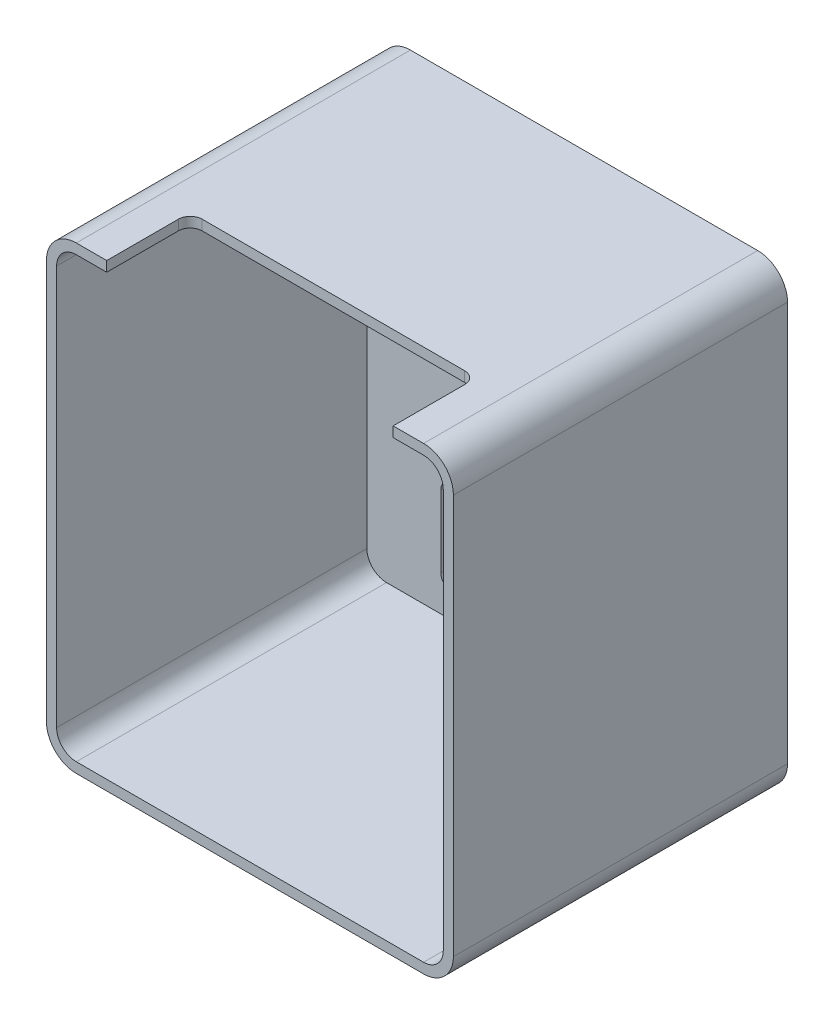
ISO-10303-21;
HEADER;
FILE_DESCRIPTION(('STEP AP214'),'2;1');
FILE_NAME('part.step','',(''),(''),'','','');
FILE_SCHEMA(('AUTOMOTIVE_DESIGN { 1 0 10303 214 1 1 1 1 }'));
ENDSEC;
DATA;
#1=APPLICATION_CONTEXT('core data for automotive mechanical design processes');
#2=APPLICATION_PROTOCOL_DEFINITION('international standard','automotive_design',2000,#1);
#3=PRODUCT_CONTEXT('',#1,'mechanical');
#4=PRODUCT('Part','Part','',(#3));
#5=PRODUCT_RELATED_PRODUCT_CATEGORY('part','',(#4));
#6=PRODUCT_DEFINITION_FORMATION('','',#4);
#7=PRODUCT_DEFINITION_CONTEXT('part definition',#1,'design');
#8=PRODUCT_DEFINITION('design','',#6,#7);
#9=PRODUCT_DEFINITION_SHAPE('','',#8);
#10=(LENGTH_UNIT() NAMED_UNIT(*) SI_UNIT(.MILLI.,.METRE.));
#11=(NAMED_UNIT(*) PLANE_ANGLE_UNIT() SI_UNIT($,.RADIAN.));
#12=(NAMED_UNIT(*) SI_UNIT($,.STERADIAN.) SOLID_ANGLE_UNIT());
#13=UNCERTAINTY_MEASURE_WITH_UNIT(LENGTH_MEASURE(1.E-05),#10,'distance_accuracy_value','');
#14=(GEOMETRIC_REPRESENTATION_CONTEXT(3) GLOBAL_UNCERTAINTY_ASSIGNED_CONTEXT((#13)) GLOBAL_UNIT_ASSIGNED_CONTEXT((#10,
#11,#12)) REPRESENTATION_CONTEXT('',''));
#15=CARTESIAN_POINT('',(0.,0.,0.));
#16=DIRECTION('',(0.,0.,1.));
#17=DIRECTION('',(1.,0.,0.));
#18=AXIS2_PLACEMENT_3D('',#15,#16,#17);
#19=CARTESIAN_POINT('',(0.,18.4,28.));
#20=DIRECTION('',(0.,1.,0.));
#21=DIRECTION('',(0.,0.,1.));
#22=AXIS2_PLACEMENT_3D('',#19,#20,#21);
#23=PLANE('',#22);
#24=DIRECTION('',(0.,0.,1.));
#25=VECTOR('',#24,1.);
#26=CARTESIAN_POINT('',(12.,18.4,28.));
#27=LINE('',#26,#25);
#28=CARTESIAN_POINT('',(12.,18.4,22.));
#29=VERTEX_POINT('',#28);
#30=CARTESIAN_POINT('',(12.,18.4,28.));
#31=VERTEX_POINT('',#30);
#32=EDGE_CURVE('E251',#29,#31,#27,.T.);
#33=ORIENTED_EDGE('',*,*,#32,.F.);
#34=CARTESIAN_POINT('',(11.,18.4,22.));
#35=DIRECTION('',(0.,1.,0.));
#36=DIRECTION('',(0.,0.,1.));
#37=AXIS2_PLACEMENT_3D('',#34,#35,#36);
#38=CIRCLE('',#37,0.999999999999998);
#39=CARTESIAN_POINT('',(11.,18.4,21.));
#40=VERTEX_POINT('',#39);
#41=EDGE_CURVE('E578',#29,#40,#38,.T.);
#42=ORIENTED_EDGE('',*,*,#41,.T.);
#43=DIRECTION('',(-1.,0.,0.));
#44=VECTOR('',#43,1.);
#45=CARTESIAN_POINT('',(0.,18.4,21.));
#46=LINE('',#45,#44);
#47=CARTESIAN_POINT('',(-11.,18.4,21.));
#48=VERTEX_POINT('',#47);
#49=EDGE_CURVE('E670',#40,#48,#46,.T.);
#50=ORIENTED_EDGE('',*,*,#49,.T.);
#51=CARTESIAN_POINT('',(-11.,18.4,22.));
#52=DIRECTION('',(0.,1.,0.));
#53=DIRECTION('',(0.,0.,1.));
#54=AXIS2_PLACEMENT_3D('',#51,#52,#53);
#55=CIRCLE('',#54,0.999999999999998);
#56=CARTESIAN_POINT('',(-12.,18.4,22.));
#57=VERTEX_POINT('',#56);
#58=EDGE_CURVE('E666',#48,#57,#55,.T.);
#59=ORIENTED_EDGE('',*,*,#58,.T.);
#60=DIRECTION('',(0.,0.,1.));
#61=VECTOR('',#60,1.);
#62=CARTESIAN_POINT('',(-12.,18.4,28.));
#63=LINE('',#62,#61);
#64=CARTESIAN_POINT('',(-12.,18.4,28.));
#65=VERTEX_POINT('',#64);
#66=EDGE_CURVE('E256',#57,#65,#63,.T.);
#67=ORIENTED_EDGE('',*,*,#66,.T.);
#68=DIRECTION('',(1.,0.,0.));
#69=VECTOR('',#68,1.);
#70=CARTESIAN_POINT('',(0.,18.4,28.));
#71=LINE('',#70,#69);
#72=CARTESIAN_POINT('',(-14.55,18.4,28.));
#73=VERTEX_POINT('',#72);
#74=EDGE_CURVE('E302',#73,#65,#71,.T.);
#75=ORIENTED_EDGE('',*,*,#74,.F.);
#76=DIRECTION('',(0.,0.,-1.));
#77=VECTOR('',#76,1.);
#78=CARTESIAN_POINT('',(-14.55,18.4,28.));
#79=LINE('',#78,#77);
#80=CARTESIAN_POINT('',(-14.55,18.4,2.));
#81=VERTEX_POINT('',#80);
#82=EDGE_CURVE('E364',#73,#81,#79,.T.);
#83=ORIENTED_EDGE('',*,*,#82,.T.);
#84=DIRECTION('',(1.,0.,0.));
#85=VECTOR('',#84,1.);
#86=CARTESIAN_POINT('',(0.,18.4,2.));
#87=LINE('',#86,#85);
#88=CARTESIAN_POINT('',(14.55,18.4,2.));
#89=VERTEX_POINT('',#88);
#90=EDGE_CURVE('E535',#81,#89,#87,.T.);
#91=ORIENTED_EDGE('',*,*,#90,.T.);
#92=DIRECTION('',(0.,0.,-1.));
#93=VECTOR('',#92,1.);
#94=CARTESIAN_POINT('',(14.55,18.4,28.));
#95=LINE('',#94,#93);
#96=CARTESIAN_POINT('',(14.55,18.4,28.));
#97=VERTEX_POINT('',#96);
#98=EDGE_CURVE('E360',#97,#89,#95,.T.);
#99=ORIENTED_EDGE('',*,*,#98,.F.);
#100=EDGE_CURVE('E301',#31,#97,#71,.T.);
#101=ORIENTED_EDGE('',*,*,#100,.F.);
#102=EDGE_LOOP('',(#33,#42,#50,#59,#67,#75,#83,#91,#99,#101));
#103=FACE_BOUND('',#102,.T.);
#104=ADVANCED_FACE('F45',(#103),#23,.F.);
#105=CARTESIAN_POINT('',(0.,19.25,28.));
#106=DIRECTION('',(0.,1.,0.));
#107=DIRECTION('',(0.,0.,1.));
#108=AXIS2_PLACEMENT_3D('',#105,#106,#107);
#109=PLANE('',#108);
#110=CARTESIAN_POINT('',(11.,19.25,22.));
#111=DIRECTION('',(0.,-1.,0.));
#112=DIRECTION('',(0.,0.,-1.));
#113=AXIS2_PLACEMENT_3D('',#110,#111,#112);
#114=CIRCLE('',#113,0.999999999999998);
#115=CARTESIAN_POINT('',(11.,19.25,21.));
#116=VERTEX_POINT('',#115);
#117=CARTESIAN_POINT('',(12.,19.25,22.));
#118=VERTEX_POINT('',#117);
#119=EDGE_CURVE('E266',#116,#118,#114,.T.);
#120=ORIENTED_EDGE('',*,*,#119,.T.);
#121=DIRECTION('',(0.,0.,-1.));
#122=VECTOR('',#121,1.);
#123=CARTESIAN_POINT('',(12.,19.25,28.));
#124=LINE('',#123,#122);
#125=CARTESIAN_POINT('',(12.,19.25,28.));
#126=VERTEX_POINT('',#125);
#127=EDGE_CURVE('E248',#126,#118,#124,.T.);
#128=ORIENTED_EDGE('',*,*,#127,.F.);
#129=DIRECTION('',(1.,0.,0.));
#130=VECTOR('',#129,1.);
#131=CARTESIAN_POINT('',(0.,19.25,28.));
#132=LINE('',#131,#130);
#133=CARTESIAN_POINT('',(14.55,19.25,28.));
#134=VERTEX_POINT('',#133);
#135=EDGE_CURVE('E262',#126,#134,#132,.T.);
#136=ORIENTED_EDGE('',*,*,#135,.T.);
#137=DIRECTION('',(0.,0.,-1.));
#138=VECTOR('',#137,1.);
#139=CARTESIAN_POINT('',(14.55,19.25,28.));
#140=LINE('',#139,#138);
#141=CARTESIAN_POINT('',(14.55,19.25,0.));
#142=VERTEX_POINT('',#141);
#143=EDGE_CURVE('E377',#134,#142,#140,.T.);
#144=ORIENTED_EDGE('',*,*,#143,.T.);
#145=DIRECTION('',(1.,0.,0.));
#146=VECTOR('',#145,1.);
#147=CARTESIAN_POINT('',(0.,19.25,0.));
#148=LINE('',#147,#146);
#149=CARTESIAN_POINT('',(-14.55,19.25,0.));
#150=VERTEX_POINT('',#149);
#151=EDGE_CURVE('E345',#150,#142,#148,.T.);
#152=ORIENTED_EDGE('',*,*,#151,.F.);
#153=DIRECTION('',(0.,0.,-1.));
#154=VECTOR('',#153,1.);
#155=CARTESIAN_POINT('',(-14.55,19.25,28.));
#156=LINE('',#155,#154);
#157=CARTESIAN_POINT('',(-14.55,19.25,28.));
#158=VERTEX_POINT('',#157);
#159=EDGE_CURVE('E317',#158,#150,#156,.T.);
#160=ORIENTED_EDGE('',*,*,#159,.F.);
#161=CARTESIAN_POINT('',(-12.,19.25,28.));
#162=VERTEX_POINT('',#161);
#163=EDGE_CURVE('E274',#158,#162,#132,.T.);
#164=ORIENTED_EDGE('',*,*,#163,.T.);
#165=DIRECTION('',(0.,0.,-1.));
#166=VECTOR('',#165,1.);
#167=CARTESIAN_POINT('',(-12.,19.25,28.));
#168=LINE('',#167,#166);
#169=CARTESIAN_POINT('',(-12.,19.25,22.));
#170=VERTEX_POINT('',#169);
#171=EDGE_CURVE('E63',#162,#170,#168,.T.);
#172=ORIENTED_EDGE('',*,*,#171,.T.);
#173=CARTESIAN_POINT('',(-11.,19.25,22.));
#174=DIRECTION('',(0.,-1.,0.));
#175=DIRECTION('',(0.,0.,-1.));
#176=AXIS2_PLACEMENT_3D('',#173,#174,#175);
#177=CIRCLE('',#176,0.999999999999998);
#178=CARTESIAN_POINT('',(-11.,19.25,21.));
#179=VERTEX_POINT('',#178);
#180=EDGE_CURVE('E635',#170,#179,#177,.T.);
#181=ORIENTED_EDGE('',*,*,#180,.T.);
#182=DIRECTION('',(1.,0.,0.));
#183=VECTOR('',#182,1.);
#184=CARTESIAN_POINT('',(-11.,19.25,21.));
#185=LINE('',#184,#183);
#186=EDGE_CURVE('E644',#179,#116,#185,.T.);
#187=ORIENTED_EDGE('',*,*,#186,.T.);
#188=EDGE_LOOP('',(#120,#128,#136,#144,#152,#160,#164,#172,#181,#187));
#189=FACE_BOUND('',#188,.T.);
#190=ADVANCED_FACE('F261',(#189),#109,.T.);
#191=CARTESIAN_POINT('',(0.,0.,28.));
#192=DIRECTION('',(0.,0.,1.));
#193=DIRECTION('',(1.,0.,0.));
#194=AXIS2_PLACEMENT_3D('',#191,#192,#193);
#195=PLANE('',#194);
#196=ORIENTED_EDGE('',*,*,#135,.F.);
#197=DIRECTION('',(0.,-1.,0.));
#198=VECTOR('',#197,1.);
#199=CARTESIAN_POINT('',(12.,19.25,28.));
#200=LINE('',#199,#198);
#201=EDGE_CURVE('E244',#126,#31,#200,.T.);
#202=ORIENTED_EDGE('',*,*,#201,.T.);
#203=ORIENTED_EDGE('',*,*,#100,.T.);
#204=CARTESIAN_POINT('',(14.55,16.75,28.));
#205=DIRECTION('',(0.,0.,1.));
#206=DIRECTION('',(1.,0.,0.));
#207=AXIS2_PLACEMENT_3D('',#204,#205,#206);
#208=CIRCLE('',#207,1.65);
#209=CARTESIAN_POINT('',(16.2,16.75,28.));
#210=VERTEX_POINT('',#209);
#211=EDGE_CURVE('E306',#97,#210,#208,.F.);
#212=ORIENTED_EDGE('',*,*,#211,.T.);
#213=DIRECTION('',(0.,1.,0.));
#214=VECTOR('',#213,1.);
#215=CARTESIAN_POINT('',(16.2,0.,28.));
#216=LINE('',#215,#214);
#217=CARTESIAN_POINT('',(16.2,-16.75,28.));
#218=VERTEX_POINT('',#217);
#219=EDGE_CURVE('E309',#218,#210,#216,.T.);
#220=ORIENTED_EDGE('',*,*,#219,.F.);
#221=CARTESIAN_POINT('',(14.55,-16.75,28.));
#222=DIRECTION('',(0.,0.,1.));
#223=DIRECTION('',(1.,0.,0.));
#224=AXIS2_PLACEMENT_3D('',#221,#222,#223);
#225=CIRCLE('',#224,1.65);
#226=CARTESIAN_POINT('',(14.55,-18.4,28.));
#227=VERTEX_POINT('',#226);
#228=EDGE_CURVE('E313',#227,#218,#225,.T.);
#229=ORIENTED_EDGE('',*,*,#228,.F.);
#230=DIRECTION('',(1.,0.,0.));
#231=VECTOR('',#230,1.);
#232=CARTESIAN_POINT('',(0.,-18.4,28.));
#233=LINE('',#232,#231);
#234=CARTESIAN_POINT('',(-14.55,-18.4,28.));
#235=VERTEX_POINT('',#234);
#236=EDGE_CURVE('E281',#235,#227,#233,.T.);
#237=ORIENTED_EDGE('',*,*,#236,.F.);
#238=CARTESIAN_POINT('',(-14.55,-16.75,28.));
#239=DIRECTION('',(0.,0.,1.));
#240=DIRECTION('',(1.,0.,0.));
#241=AXIS2_PLACEMENT_3D('',#238,#239,#240);
#242=CIRCLE('',#241,1.65);
#243=CARTESIAN_POINT('',(-16.2,-16.75,28.));
#244=VERTEX_POINT('',#243);
#245=EDGE_CURVE('E289',#235,#244,#242,.F.);
#246=ORIENTED_EDGE('',*,*,#245,.T.);
#247=DIRECTION('',(0.,1.,0.));
#248=VECTOR('',#247,1.);
#249=CARTESIAN_POINT('',(-16.2,0.,28.));
#250=LINE('',#249,#248);
#251=CARTESIAN_POINT('',(-16.2,16.75,28.));
#252=VERTEX_POINT('',#251);
#253=EDGE_CURVE('E293',#244,#252,#250,.T.);
#254=ORIENTED_EDGE('',*,*,#253,.T.);
#255=CARTESIAN_POINT('',(-14.55,16.75,28.));
#256=DIRECTION('',(0.,0.,1.));
#257=DIRECTION('',(1.,0.,0.));
#258=AXIS2_PLACEMENT_3D('',#255,#256,#257);
#259=CIRCLE('',#258,1.65);
#260=EDGE_CURVE('E297',#252,#73,#259,.F.);
#261=ORIENTED_EDGE('',*,*,#260,.T.);
#262=ORIENTED_EDGE('',*,*,#74,.T.);
#263=DIRECTION('',(0.,-1.,0.));
#264=VECTOR('',#263,1.);
#265=CARTESIAN_POINT('',(-12.,19.25,28.));
#266=LINE('',#265,#264);
#267=EDGE_CURVE('E632',#162,#65,#266,.T.);
#268=ORIENTED_EDGE('',*,*,#267,.F.);
#269=ORIENTED_EDGE('',*,*,#163,.F.);
#270=CARTESIAN_POINT('',(-14.55,16.75,28.));
#271=DIRECTION('',(0.,0.,1.));
#272=DIRECTION('',(1.,0.,0.));
#273=AXIS2_PLACEMENT_3D('',#270,#271,#272);
#274=CIRCLE('',#273,2.5);
#275=CARTESIAN_POINT('',(-17.05,16.75,28.));
#276=VERTEX_POINT('',#275);
#277=EDGE_CURVE('E349',#276,#158,#274,.F.);
#278=ORIENTED_EDGE('',*,*,#277,.F.);
#279=DIRECTION('',(0.,1.,0.));
#280=VECTOR('',#279,1.);
#281=CARTESIAN_POINT('',(-17.05,0.,28.));
#282=LINE('',#281,#280);
#283=CARTESIAN_POINT('',(-17.05,-16.75,28.));
#284=VERTEX_POINT('',#283);
#285=EDGE_CURVE('E409',#284,#276,#282,.T.);
#286=ORIENTED_EDGE('',*,*,#285,.F.);
#287=CARTESIAN_POINT('',(-14.55,-16.75,28.));
#288=DIRECTION('',(0.,0.,1.));
#289=DIRECTION('',(1.,0.,0.));
#290=AXIS2_PLACEMENT_3D('',#287,#288,#289);
#291=CIRCLE('',#290,2.5);
#292=CARTESIAN_POINT('',(-14.55,-19.25,28.));
#293=VERTEX_POINT('',#292);
#294=EDGE_CURVE('E422',#293,#284,#291,.F.);
#295=ORIENTED_EDGE('',*,*,#294,.F.);
#296=DIRECTION('',(1.,0.,0.));
#297=VECTOR('',#296,1.);
#298=CARTESIAN_POINT('',(0.,-19.25,28.));
#299=LINE('',#298,#297);
#300=CARTESIAN_POINT('',(14.55,-19.25,28.));
#301=VERTEX_POINT('',#300);
#302=EDGE_CURVE('E425',#293,#301,#299,.T.);
#303=ORIENTED_EDGE('',*,*,#302,.T.);
#304=CARTESIAN_POINT('',(14.55,-16.75,28.));
#305=DIRECTION('',(0.,0.,1.));
#306=DIRECTION('',(1.,0.,0.));
#307=AXIS2_PLACEMENT_3D('',#304,#305,#306);
#308=CIRCLE('',#307,2.5);
#309=CARTESIAN_POINT('',(17.05,-16.75,28.));
#310=VERTEX_POINT('',#309);
#311=EDGE_CURVE('E429',#301,#310,#308,.T.);
#312=ORIENTED_EDGE('',*,*,#311,.T.);
#313=DIRECTION('',(0.,1.,0.));
#314=VECTOR('',#313,1.);
#315=CARTESIAN_POINT('',(17.05,0.,28.));
#316=LINE('',#315,#314);
#317=CARTESIAN_POINT('',(17.05,16.75,28.));
#318=VERTEX_POINT('',#317);
#319=EDGE_CURVE('E282',#310,#318,#316,.T.);
#320=ORIENTED_EDGE('',*,*,#319,.T.);
#321=CARTESIAN_POINT('',(14.55,16.75,28.));
#322=DIRECTION('',(0.,0.,1.));
#323=DIRECTION('',(1.,0.,0.));
#324=AXIS2_PLACEMENT_3D('',#321,#322,#323);
#325=CIRCLE('',#324,2.5);
#326=EDGE_CURVE('E272',#134,#318,#325,.F.);
#327=ORIENTED_EDGE('',*,*,#326,.F.);
#328=EDGE_LOOP('',(#196,#202,#203,#212,#220,#229,#237,#246,#254,#261,#262,#268,#269,#278,#286,
#295,#303,#312,#320,#327));
#329=FACE_BOUND('',#328,.T.);
#330=ADVANCED_FACE('F270',(#329),#195,.T.);
#331=CARTESIAN_POINT('',(0.,-18.4,28.));
#332=DIRECTION('',(0.,1.,0.));
#333=DIRECTION('',(0.,0.,1.));
#334=AXIS2_PLACEMENT_3D('',#331,#332,#333);
#335=PLANE('',#334);
#336=DIRECTION('',(1.,0.,0.));
#337=VECTOR('',#336,1.);
#338=CARTESIAN_POINT('',(0.,-18.4,2.));
#339=LINE('',#338,#337);
#340=CARTESIAN_POINT('',(-14.55,-18.4,2.));
#341=VERTEX_POINT('',#340);
#342=CARTESIAN_POINT('',(14.55,-18.4,2.));
#343=VERTEX_POINT('',#342);
#344=EDGE_CURVE('E71',#341,#343,#339,.T.);
#345=ORIENTED_EDGE('',*,*,#344,.F.);
#346=DIRECTION('',(0.,0.,-1.));
#347=VECTOR('',#346,1.);
#348=CARTESIAN_POINT('',(-14.55,-18.4,28.));
#349=LINE('',#348,#347);
#350=EDGE_CURVE('E11',#235,#341,#349,.T.);
#351=ORIENTED_EDGE('',*,*,#350,.F.);
#352=ORIENTED_EDGE('',*,*,#236,.T.);
#353=DIRECTION('',(0.,0.,-1.));
#354=VECTOR('',#353,1.);
#355=CARTESIAN_POINT('',(14.55,-18.4,28.));
#356=LINE('',#355,#354);
#357=EDGE_CURVE('E350',#227,#343,#356,.T.);
#358=ORIENTED_EDGE('',*,*,#357,.T.);
#359=EDGE_LOOP('',(#345,#351,#352,#358));
#360=FACE_BOUND('',#359,.T.);
#361=ADVANCED_FACE('F484',(#360),#335,.T.);
#362=CARTESIAN_POINT('',(-14.55,-16.75,28.));
#363=DIRECTION('',(0.,0.,-1.));
#364=DIRECTION('',(-1.,0.,0.));
#365=AXIS2_PLACEMENT_3D('',#362,#363,#364);
#366=CYLINDRICAL_SURFACE('',#365,1.65);
#367=ORIENTED_EDGE('',*,*,#350,.T.);
#368=CARTESIAN_POINT('',(-14.55,-16.75,2.));
#369=DIRECTION('',(0.,0.,1.));
#370=DIRECTION('',(1.,0.,0.));
#371=AXIS2_PLACEMENT_3D('',#368,#369,#370);
#372=CIRCLE('',#371,1.65);
#373=CARTESIAN_POINT('',(-16.2,-16.75,2.));
#374=VERTEX_POINT('',#373);
#375=EDGE_CURVE('E529',#341,#374,#372,.F.);
#376=ORIENTED_EDGE('',*,*,#375,.T.);
#377=DIRECTION('',(0.,0.,-1.));
#378=VECTOR('',#377,1.);
#379=CARTESIAN_POINT('',(-16.2,-16.75,28.));
#380=LINE('',#379,#378);
#381=EDGE_CURVE('E55',#244,#374,#380,.T.);
#382=ORIENTED_EDGE('',*,*,#381,.F.);
#383=ORIENTED_EDGE('',*,*,#245,.F.);
#384=EDGE_LOOP('',(#367,#376,#382,#383));
#385=FACE_BOUND('',#384,.T.);
#386=ADVANCED_FACE('F480',(#385),#366,.F.);
#387=CARTESIAN_POINT('',(-16.2,0.,28.));
#388=DIRECTION('',(-1.,0.,0.));
#389=DIRECTION('',(0.,0.,1.));
#390=AXIS2_PLACEMENT_3D('',#387,#388,#389);
#391=PLANE('',#390);
#392=ORIENTED_EDGE('',*,*,#381,.T.);
#393=DIRECTION('',(0.,1.,0.));
#394=VECTOR('',#393,1.);
#395=CARTESIAN_POINT('',(-16.2,0.,2.));
#396=LINE('',#395,#394);
#397=CARTESIAN_POINT('',(-16.2,16.75,2.));
#398=VERTEX_POINT('',#397);
#399=EDGE_CURVE('E541',#374,#398,#396,.T.);
#400=ORIENTED_EDGE('',*,*,#399,.T.);
#401=DIRECTION('',(0.,0.,-1.));
#402=VECTOR('',#401,1.);
#403=CARTESIAN_POINT('',(-16.2,16.75,28.));
#404=LINE('',#403,#402);
#405=EDGE_CURVE('E368',#252,#398,#404,.T.);
#406=ORIENTED_EDGE('',*,*,#405,.F.);
#407=ORIENTED_EDGE('',*,*,#253,.F.);
#408=EDGE_LOOP('',(#392,#400,#406,#407));
#409=FACE_BOUND('',#408,.T.);
#410=ADVANCED_FACE('F476',(#409),#391,.F.);
#411=CARTESIAN_POINT('',(-14.55,16.75,28.));
#412=DIRECTION('',(0.,0.,-1.));
#413=DIRECTION('',(-1.,0.,0.));
#414=AXIS2_PLACEMENT_3D('',#411,#412,#413);
#415=CYLINDRICAL_SURFACE('',#414,1.65);
#416=ORIENTED_EDGE('',*,*,#405,.T.);
#417=CARTESIAN_POINT('',(-14.55,16.75,2.));
#418=DIRECTION('',(0.,0.,1.));
#419=DIRECTION('',(1.,0.,0.));
#420=AXIS2_PLACEMENT_3D('',#417,#418,#419);
#421=CIRCLE('',#420,1.65);
#422=EDGE_CURVE('E538',#398,#81,#421,.F.);
#423=ORIENTED_EDGE('',*,*,#422,.T.);
#424=ORIENTED_EDGE('',*,*,#82,.F.);
#425=ORIENTED_EDGE('',*,*,#260,.F.);
#426=EDGE_LOOP('',(#416,#423,#424,#425));
#427=FACE_BOUND('',#426,.T.);
#428=ADVANCED_FACE('F473',(#427),#415,.F.);
#429=CARTESIAN_POINT('',(14.55,16.75,28.));
#430=DIRECTION('',(0.,0.,-1.));
#431=DIRECTION('',(-1.,0.,0.));
#432=AXIS2_PLACEMENT_3D('',#429,#430,#431);
#433=CYLINDRICAL_SURFACE('',#432,1.65);
#434=ORIENTED_EDGE('',*,*,#98,.T.);
#435=CARTESIAN_POINT('',(14.55,16.75,2.));
#436=DIRECTION('',(0.,0.,1.));
#437=DIRECTION('',(1.,0.,0.));
#438=AXIS2_PLACEMENT_3D('',#435,#436,#437);
#439=CIRCLE('',#438,1.65);
#440=CARTESIAN_POINT('',(16.2,16.75,2.));
#441=VERTEX_POINT('',#440);
#442=EDGE_CURVE('E518',#89,#441,#439,.F.);
#443=ORIENTED_EDGE('',*,*,#442,.T.);
#444=DIRECTION('',(0.,0.,-1.));
#445=VECTOR('',#444,1.);
#446=CARTESIAN_POINT('',(16.2,16.75,28.));
#447=LINE('',#446,#445);
#448=EDGE_CURVE('E356',#210,#441,#447,.T.);
#449=ORIENTED_EDGE('',*,*,#448,.F.);
#450=ORIENTED_EDGE('',*,*,#211,.F.);
#451=EDGE_LOOP('',(#434,#443,#449,#450));
#452=FACE_BOUND('',#451,.T.);
#453=ADVANCED_FACE('F471',(#452),#433,.F.);
#454=CARTESIAN_POINT('',(16.2,0.,28.));
#455=DIRECTION('',(-1.,0.,0.));
#456=DIRECTION('',(0.,0.,1.));
#457=AXIS2_PLACEMENT_3D('',#454,#455,#456);
#458=PLANE('',#457);
#459=DIRECTION('',(0.,1.,0.));
#460=VECTOR('',#459,1.);
#461=CARTESIAN_POINT('',(16.2,0.,2.));
#462=LINE('',#461,#460);
#463=CARTESIAN_POINT('',(16.2,-16.75,2.));
#464=VERTEX_POINT('',#463);
#465=EDGE_CURVE('E511',#464,#441,#462,.T.);
#466=ORIENTED_EDGE('',*,*,#465,.F.);
#467=DIRECTION('',(0.,0.,-1.));
#468=VECTOR('',#467,1.);
#469=CARTESIAN_POINT('',(16.2,-16.75,28.));
#470=LINE('',#469,#468);
#471=EDGE_CURVE('E353',#218,#464,#470,.T.);
#472=ORIENTED_EDGE('',*,*,#471,.F.);
#473=ORIENTED_EDGE('',*,*,#219,.T.);
#474=ORIENTED_EDGE('',*,*,#448,.T.);
#475=EDGE_LOOP('',(#466,#472,#473,#474));
#476=FACE_BOUND('',#475,.T.);
#477=ADVANCED_FACE('F501',(#476),#458,.T.);
#478=CARTESIAN_POINT('',(-14.55,16.75,28.));
#479=DIRECTION('',(0.,0.,-1.));
#480=DIRECTION('',(-1.,0.,0.));
#481=AXIS2_PLACEMENT_3D('',#478,#479,#480);
#482=CYLINDRICAL_SURFACE('',#481,2.5);
#483=CARTESIAN_POINT('',(-14.55,16.75,0.));
#484=DIRECTION('',(0.,0.,1.));
#485=DIRECTION('',(1.,0.,0.));
#486=AXIS2_PLACEMENT_3D('',#483,#484,#485);
#487=CIRCLE('',#486,2.5);
#488=CARTESIAN_POINT('',(-17.05,16.75,0.));
#489=VERTEX_POINT('',#488);
#490=EDGE_CURVE('E318',#489,#150,#487,.F.);
#491=ORIENTED_EDGE('',*,*,#490,.F.);
#492=DIRECTION('',(0.,0.,-1.));
#493=VECTOR('',#492,1.);
#494=CARTESIAN_POINT('',(-17.05,16.75,28.));
#495=LINE('',#494,#493);
#496=EDGE_CURVE('E49',#276,#489,#495,.T.);
#497=ORIENTED_EDGE('',*,*,#496,.F.);
#498=ORIENTED_EDGE('',*,*,#277,.T.);
#499=ORIENTED_EDGE('',*,*,#159,.T.);
#500=EDGE_LOOP('',(#491,#497,#498,#499));
#501=FACE_BOUND('',#500,.T.);
#502=ADVANCED_FACE('F47',(#501),#482,.T.);
#503=CARTESIAN_POINT('',(-17.05,0.,28.));
#504=DIRECTION('',(-1.,0.,0.));
#505=DIRECTION('',(0.,0.,1.));
#506=AXIS2_PLACEMENT_3D('',#503,#504,#505);
#507=PLANE('',#506);
#508=DIRECTION('',(0.,1.,0.));
#509=VECTOR('',#508,1.);
#510=CARTESIAN_POINT('',(-17.05,0.,0.));
#511=LINE('',#510,#509);
#512=CARTESIAN_POINT('',(-17.05,-16.75,0.));
#513=VERTEX_POINT('',#512);
#514=EDGE_CURVE('E322',#513,#489,#511,.T.);
#515=ORIENTED_EDGE('',*,*,#514,.F.);
#516=DIRECTION('',(0.,0.,-1.));
#517=VECTOR('',#516,1.);
#518=CARTESIAN_POINT('',(-17.05,-16.75,28.));
#519=LINE('',#518,#517);
#520=EDGE_CURVE('E393',#284,#513,#519,.T.);
#521=ORIENTED_EDGE('',*,*,#520,.F.);
#522=ORIENTED_EDGE('',*,*,#285,.T.);
#523=ORIENTED_EDGE('',*,*,#496,.T.);
#524=EDGE_LOOP('',(#515,#521,#522,#523));
#525=FACE_BOUND('',#524,.T.);
#526=ADVANCED_FACE('F407',(#525),#507,.T.);
#527=CARTESIAN_POINT('',(-14.55,-16.75,28.));
#528=DIRECTION('',(0.,0.,-1.));
#529=DIRECTION('',(-1.,0.,0.));
#530=AXIS2_PLACEMENT_3D('',#527,#528,#529);
#531=CYLINDRICAL_SURFACE('',#530,2.5);
#532=CARTESIAN_POINT('',(-14.55,-16.75,0.));
#533=DIRECTION('',(0.,0.,1.));
#534=DIRECTION('',(1.,0.,0.));
#535=AXIS2_PLACEMENT_3D('',#532,#533,#534);
#536=CIRCLE('',#535,2.5);
#537=CARTESIAN_POINT('',(-14.55,-19.25,0.));
#538=VERTEX_POINT('',#537);
#539=EDGE_CURVE('E327',#538,#513,#536,.F.);
#540=ORIENTED_EDGE('',*,*,#539,.F.);
#541=DIRECTION('',(0.,0.,-1.));
#542=VECTOR('',#541,1.);
#543=CARTESIAN_POINT('',(-14.55,-19.25,28.));
#544=LINE('',#543,#542);
#545=EDGE_CURVE('E391',#293,#538,#544,.T.);
#546=ORIENTED_EDGE('',*,*,#545,.F.);
#547=ORIENTED_EDGE('',*,*,#294,.T.);
#548=ORIENTED_EDGE('',*,*,#520,.T.);
#549=EDGE_LOOP('',(#540,#546,#547,#548));
#550=FACE_BOUND('',#549,.T.);
#551=ADVANCED_FACE('F419',(#550),#531,.T.);
#552=CARTESIAN_POINT('',(0.,-19.25,28.));
#553=DIRECTION('',(0.,1.,0.));
#554=DIRECTION('',(0.,0.,1.));
#555=AXIS2_PLACEMENT_3D('',#552,#553,#554);
#556=PLANE('',#555);
#557=DIRECTION('',(1.,0.,0.));
#558=VECTOR('',#557,1.);
#559=CARTESIAN_POINT('',(0.,-19.25,0.));
#560=LINE('',#559,#558);
#561=CARTESIAN_POINT('',(14.55,-19.25,0.));
#562=VERTEX_POINT('',#561);
#563=EDGE_CURVE('E331',#538,#562,#560,.T.);
#564=ORIENTED_EDGE('',*,*,#563,.T.);
#565=DIRECTION('',(0.,0.,-1.));
#566=VECTOR('',#565,1.);
#567=CARTESIAN_POINT('',(14.55,-19.25,28.));
#568=LINE('',#567,#566);
#569=EDGE_CURVE('E387',#301,#562,#568,.T.);
#570=ORIENTED_EDGE('',*,*,#569,.F.);
#571=ORIENTED_EDGE('',*,*,#302,.F.);
#572=ORIENTED_EDGE('',*,*,#545,.T.);
#573=EDGE_LOOP('',(#564,#570,#571,#572));
#574=FACE_BOUND('',#573,.T.);
#575=ADVANCED_FACE('F426',(#574),#556,.F.);
#576=CARTESIAN_POINT('',(14.55,-16.75,28.));
#577=DIRECTION('',(0.,0.,-1.));
#578=DIRECTION('',(-1.,0.,0.));
#579=AXIS2_PLACEMENT_3D('',#576,#577,#578);
#580=CYLINDRICAL_SURFACE('',#579,2.5);
#581=CARTESIAN_POINT('',(14.55,-16.75,0.));
#582=DIRECTION('',(0.,0.,1.));
#583=DIRECTION('',(1.,0.,0.));
#584=AXIS2_PLACEMENT_3D('',#581,#582,#583);
#585=CIRCLE('',#584,2.5);
#586=CARTESIAN_POINT('',(17.05,-16.75,0.));
#587=VERTEX_POINT('',#586);
#588=EDGE_CURVE('E334',#562,#587,#585,.T.);
#589=ORIENTED_EDGE('',*,*,#588,.T.);
#590=DIRECTION('',(0.,0.,-1.));
#591=VECTOR('',#590,1.);
#592=CARTESIAN_POINT('',(17.05,-16.75,28.));
#593=LINE('',#592,#591);
#594=EDGE_CURVE('E383',#310,#587,#593,.T.);
#595=ORIENTED_EDGE('',*,*,#594,.F.);
#596=ORIENTED_EDGE('',*,*,#311,.F.);
#597=ORIENTED_EDGE('',*,*,#569,.T.);
#598=EDGE_LOOP('',(#589,#595,#596,#597));
#599=FACE_BOUND('',#598,.T.);
#600=ADVANCED_FACE('F453',(#599),#580,.T.);
#601=CARTESIAN_POINT('',(17.05,0.,28.));
#602=DIRECTION('',(-1.,0.,0.));
#603=DIRECTION('',(0.,0.,1.));
#604=AXIS2_PLACEMENT_3D('',#601,#602,#603);
#605=PLANE('',#604);
#606=DIRECTION('',(0.,1.,0.));
#607=VECTOR('',#606,1.);
#608=CARTESIAN_POINT('',(17.05,0.,0.));
#609=LINE('',#608,#607);
#610=CARTESIAN_POINT('',(17.05,16.75,0.));
#611=VERTEX_POINT('',#610);
#612=EDGE_CURVE('E337',#587,#611,#609,.T.);
#613=ORIENTED_EDGE('',*,*,#612,.T.);
#614=DIRECTION('',(0.,0.,-1.));
#615=VECTOR('',#614,1.);
#616=CARTESIAN_POINT('',(17.05,16.75,28.));
#617=LINE('',#616,#615);
#618=EDGE_CURVE('E380',#318,#611,#617,.T.);
#619=ORIENTED_EDGE('',*,*,#618,.F.);
#620=ORIENTED_EDGE('',*,*,#319,.F.);
#621=ORIENTED_EDGE('',*,*,#594,.T.);
#622=EDGE_LOOP('',(#613,#619,#620,#621));
#623=FACE_BOUND('',#622,.T.);
#624=ADVANCED_FACE('F447',(#623),#605,.F.);
#625=CARTESIAN_POINT('',(14.55,16.75,28.));
#626=DIRECTION('',(0.,0.,-1.));
#627=DIRECTION('',(-1.,0.,0.));
#628=AXIS2_PLACEMENT_3D('',#625,#626,#627);
#629=CYLINDRICAL_SURFACE('',#628,2.5);
#630=CARTESIAN_POINT('',(14.55,16.75,0.));
#631=DIRECTION('',(0.,0.,1.));
#632=DIRECTION('',(1.,0.,0.));
#633=AXIS2_PLACEMENT_3D('',#630,#631,#632);
#634=CIRCLE('',#633,2.5);
#635=EDGE_CURVE('E341',#142,#611,#634,.F.);
#636=ORIENTED_EDGE('',*,*,#635,.F.);
#637=ORIENTED_EDGE('',*,*,#143,.F.);
#638=ORIENTED_EDGE('',*,*,#326,.T.);
#639=ORIENTED_EDGE('',*,*,#618,.T.);
#640=EDGE_LOOP('',(#636,#637,#638,#639));
#641=FACE_BOUND('',#640,.T.);
#642=ADVANCED_FACE('F451',(#641),#629,.T.);
#643=CARTESIAN_POINT('',(14.55,-16.75,28.));
#644=DIRECTION('',(0.,0.,-1.));
#645=DIRECTION('',(-1.,0.,0.));
#646=AXIS2_PLACEMENT_3D('',#643,#644,#645);
#647=CYLINDRICAL_SURFACE('',#646,1.65);
#648=CARTESIAN_POINT('',(14.55,-16.75,2.));
#649=DIRECTION('',(0.,0.,1.));
#650=DIRECTION('',(1.,0.,0.));
#651=AXIS2_PLACEMENT_3D('',#648,#649,#650);
#652=CIRCLE('',#651,1.65);
#653=EDGE_CURVE('E519',#343,#464,#652,.T.);
#654=ORIENTED_EDGE('',*,*,#653,.F.);
#655=ORIENTED_EDGE('',*,*,#357,.F.);
#656=ORIENTED_EDGE('',*,*,#228,.T.);
#657=ORIENTED_EDGE('',*,*,#471,.T.);
#658=EDGE_LOOP('',(#654,#655,#656,#657));
#659=FACE_BOUND('',#658,.T.);
#660=ADVANCED_FACE('F489',(#659),#647,.F.);
#661=CARTESIAN_POINT('',(0.,0.,0.));
#662=DIRECTION('',(0.,0.,1.));
#663=DIRECTION('',(1.,0.,0.));
#664=AXIS2_PLACEMENT_3D('',#661,#662,#663);
#665=PLANE('',#664);
#666=ORIENTED_EDGE('',*,*,#490,.T.);
#667=ORIENTED_EDGE('',*,*,#151,.T.);
#668=ORIENTED_EDGE('',*,*,#635,.T.);
#669=ORIENTED_EDGE('',*,*,#612,.F.);
#670=ORIENTED_EDGE('',*,*,#588,.F.);
#671=ORIENTED_EDGE('',*,*,#563,.F.);
#672=ORIENTED_EDGE('',*,*,#539,.T.);
#673=ORIENTED_EDGE('',*,*,#514,.T.);
#674=EDGE_LOOP('',(#666,#667,#668,#669,#670,#671,#672,#673));
#675=FACE_BOUND('',#674,.T.);
#676=DIRECTION('',(0.,1.,0.));
#677=VECTOR('',#676,1.);
#678=CARTESIAN_POINT('',(-9.99999999999999,0.,0.));
#679=LINE('',#678,#677);
#680=CARTESIAN_POINT('',(-9.99999999999999,-15.4,0.));
#681=VERTEX_POINT('',#680);
#682=CARTESIAN_POINT('',(-9.99999999999999,-9.4,0.));
#683=VERTEX_POINT('',#682);
#684=EDGE_CURVE('E573',#681,#683,#679,.T.);
#685=ORIENTED_EDGE('',*,*,#684,.F.);
#686=CARTESIAN_POINT('',(-8.99999999999999,-15.4,0.));
#687=DIRECTION('',(0.,0.,1.));
#688=DIRECTION('',(1.,0.,0.));
#689=AXIS2_PLACEMENT_3D('',#686,#687,#688);
#690=CIRCLE('',#689,1.);
#691=CARTESIAN_POINT('',(-8.99999999999999,-16.4,0.));
#692=VERTEX_POINT('',#691);
#693=EDGE_CURVE('E600',#692,#681,#690,.F.);
#694=ORIENTED_EDGE('',*,*,#693,.F.);
#695=DIRECTION('',(1.,0.,0.));
#696=VECTOR('',#695,1.);
#697=CARTESIAN_POINT('',(0.,-16.4,0.));
#698=LINE('',#697,#696);
#699=CARTESIAN_POINT('',(9.00000000000001,-16.4,0.));
#700=VERTEX_POINT('',#699);
#701=EDGE_CURVE('E596',#692,#700,#698,.T.);
#702=ORIENTED_EDGE('',*,*,#701,.T.);
#703=CARTESIAN_POINT('',(9.00000000000001,-15.4,0.));
#704=DIRECTION('',(0.,0.,1.));
#705=DIRECTION('',(1.,0.,0.));
#706=AXIS2_PLACEMENT_3D('',#703,#704,#705);
#707=CIRCLE('',#706,1.);
#708=CARTESIAN_POINT('',(10.,-15.4,0.));
#709=VERTEX_POINT('',#708);
#710=EDGE_CURVE('E592',#700,#709,#707,.T.);
#711=ORIENTED_EDGE('',*,*,#710,.T.);
#712=DIRECTION('',(0.,1.,0.));
#713=VECTOR('',#712,1.);
#714=CARTESIAN_POINT('',(10.,0.,0.));
#715=LINE('',#714,#713);
#716=CARTESIAN_POINT('',(10.,-9.4,0.));
#717=VERTEX_POINT('',#716);
#718=EDGE_CURVE('E588',#709,#717,#715,.T.);
#719=ORIENTED_EDGE('',*,*,#718,.T.);
#720=CARTESIAN_POINT('',(9.00000000000001,-9.4,0.));
#721=DIRECTION('',(0.,0.,1.));
#722=DIRECTION('',(1.,0.,0.));
#723=AXIS2_PLACEMENT_3D('',#720,#721,#722);
#724=CIRCLE('',#723,1.);
#725=CARTESIAN_POINT('',(9.00000000000001,-8.4,0.));
#726=VERTEX_POINT('',#725);
#727=EDGE_CURVE('E584',#726,#717,#724,.F.);
#728=ORIENTED_EDGE('',*,*,#727,.F.);
#729=DIRECTION('',(1.,0.,0.));
#730=VECTOR('',#729,1.);
#731=CARTESIAN_POINT('',(0.,-8.4,0.));
#732=LINE('',#731,#730);
#733=CARTESIAN_POINT('',(-8.99999999999999,-8.4,0.));
#734=VERTEX_POINT('',#733);
#735=EDGE_CURVE('E581',#734,#726,#732,.T.);
#736=ORIENTED_EDGE('',*,*,#735,.F.);
#737=CARTESIAN_POINT('',(-8.99999999999999,-9.4,0.));
#738=DIRECTION('',(0.,0.,1.));
#739=DIRECTION('',(1.,0.,0.));
#740=AXIS2_PLACEMENT_3D('',#737,#738,#739);
#741=CIRCLE('',#740,1.);
#742=EDGE_CURVE('E577',#683,#734,#741,.F.);
#743=ORIENTED_EDGE('',*,*,#742,.F.);
#744=EDGE_LOOP('',(#685,#694,#702,#711,#719,#728,#736,#743));
#745=FACE_BOUND('',#744,.T.);
#746=ADVANCED_FACE('F415',(#675,#745),#665,.F.);
#747=CARTESIAN_POINT('',(-9.99999999999999,0.,2.));
#748=DIRECTION('',(-1.,0.,0.));
#749=DIRECTION('',(0.,-1.,0.));
#750=AXIS2_PLACEMENT_3D('',#747,#748,#749);
#751=PLANE('',#750);
#752=ORIENTED_EDGE('',*,*,#684,.T.);
#753=DIRECTION('',(0.,0.,-1.));
#754=VECTOR('',#753,1.);
#755=CARTESIAN_POINT('',(-9.99999999999999,-9.4,2.));
#756=LINE('',#755,#754);
#757=CARTESIAN_POINT('',(-9.99999999999999,-9.4,2.));
#758=VERTEX_POINT('',#757);
#759=EDGE_CURVE('E323',#758,#683,#756,.T.);
#760=ORIENTED_EDGE('',*,*,#759,.F.);
#761=DIRECTION('',(0.,1.,0.));
#762=VECTOR('',#761,1.);
#763=CARTESIAN_POINT('',(-9.99999999999999,0.,2.));
#764=LINE('',#763,#762);
#765=CARTESIAN_POINT('',(-9.99999999999999,-15.4,2.));
#766=VERTEX_POINT('',#765);
#767=EDGE_CURVE('E544',#766,#758,#764,.T.);
#768=ORIENTED_EDGE('',*,*,#767,.F.);
#769=DIRECTION('',(0.,0.,-1.));
#770=VECTOR('',#769,1.);
#771=CARTESIAN_POINT('',(-9.99999999999999,-15.4,2.));
#772=LINE('',#771,#770);
#773=EDGE_CURVE('E572',#766,#681,#772,.T.);
#774=ORIENTED_EDGE('',*,*,#773,.T.);
#775=EDGE_LOOP('',(#752,#760,#768,#774));
#776=FACE_BOUND('',#775,.T.);
#777=ADVANCED_FACE('F498',(#776),#751,.F.);
#778=CARTESIAN_POINT('',(-8.99999999999999,-9.4,2.));
#779=DIRECTION('',(0.,0.,-1.));
#780=DIRECTION('',(-1.,0.,0.));
#781=AXIS2_PLACEMENT_3D('',#778,#779,#780);
#782=CYLINDRICAL_SURFACE('',#781,1.);
#783=ORIENTED_EDGE('',*,*,#742,.T.);
#784=DIRECTION('',(0.,0.,-1.));
#785=VECTOR('',#784,1.);
#786=CARTESIAN_POINT('',(-8.99999999999999,-8.4,2.));
#787=LINE('',#786,#785);
#788=CARTESIAN_POINT('',(-8.99999999999999,-8.4,2.));
#789=VERTEX_POINT('',#788);
#790=EDGE_CURVE('E622',#789,#734,#787,.T.);
#791=ORIENTED_EDGE('',*,*,#790,.F.);
#792=CARTESIAN_POINT('',(-8.99999999999999,-9.4,2.));
#793=DIRECTION('',(0.,0.,1.));
#794=DIRECTION('',(1.,0.,0.));
#795=AXIS2_PLACEMENT_3D('',#792,#793,#794);
#796=CIRCLE('',#795,1.);
#797=EDGE_CURVE('E548',#758,#789,#796,.F.);
#798=ORIENTED_EDGE('',*,*,#797,.F.);
#799=ORIENTED_EDGE('',*,*,#759,.T.);
#800=EDGE_LOOP('',(#783,#791,#798,#799));
#801=FACE_BOUND('',#800,.T.);
#802=ADVANCED_FACE('F868',(#801),#782,.F.);
#803=CARTESIAN_POINT('',(0.,-8.4,2.));
#804=DIRECTION('',(0.,1.,0.));
#805=DIRECTION('',(0.,0.,1.));
#806=AXIS2_PLACEMENT_3D('',#803,#804,#805);
#807=PLANE('',#806);
#808=ORIENTED_EDGE('',*,*,#735,.T.);
#809=DIRECTION('',(0.,0.,-1.));
#810=VECTOR('',#809,1.);
#811=CARTESIAN_POINT('',(9.00000000000001,-8.4,2.));
#812=LINE('',#811,#810);
#813=CARTESIAN_POINT('',(9.00000000000001,-8.4,2.));
#814=VERTEX_POINT('',#813);
#815=EDGE_CURVE('E618',#814,#726,#812,.T.);
#816=ORIENTED_EDGE('',*,*,#815,.F.);
#817=DIRECTION('',(1.,0.,0.));
#818=VECTOR('',#817,1.);
#819=CARTESIAN_POINT('',(0.,-8.4,2.));
#820=LINE('',#819,#818);
#821=EDGE_CURVE('E551',#789,#814,#820,.T.);
#822=ORIENTED_EDGE('',*,*,#821,.F.);
#823=ORIENTED_EDGE('',*,*,#790,.T.);
#824=EDGE_LOOP('',(#808,#816,#822,#823));
#825=FACE_BOUND('',#824,.T.);
#826=ADVANCED_FACE('F864',(#825),#807,.F.);
#827=CARTESIAN_POINT('',(9.00000000000001,-9.4,2.));
#828=DIRECTION('',(0.,0.,-1.));
#829=DIRECTION('',(-1.,0.,0.));
#830=AXIS2_PLACEMENT_3D('',#827,#828,#829);
#831=CYLINDRICAL_SURFACE('',#830,1.);
#832=ORIENTED_EDGE('',*,*,#727,.T.);
#833=DIRECTION('',(0.,0.,-1.));
#834=VECTOR('',#833,1.);
#835=CARTESIAN_POINT('',(10.,-9.4,2.));
#836=LINE('',#835,#834);
#837=CARTESIAN_POINT('',(10.,-9.4,2.));
#838=VERTEX_POINT('',#837);
#839=EDGE_CURVE('E615',#838,#717,#836,.T.);
#840=ORIENTED_EDGE('',*,*,#839,.F.);
#841=CARTESIAN_POINT('',(9.00000000000001,-9.4,2.));
#842=DIRECTION('',(0.,0.,1.));
#843=DIRECTION('',(1.,0.,0.));
#844=AXIS2_PLACEMENT_3D('',#841,#842,#843);
#845=CIRCLE('',#844,1.);
#846=EDGE_CURVE('E554',#814,#838,#845,.F.);
#847=ORIENTED_EDGE('',*,*,#846,.F.);
#848=ORIENTED_EDGE('',*,*,#815,.T.);
#849=EDGE_LOOP('',(#832,#840,#847,#848));
#850=FACE_BOUND('',#849,.T.);
#851=ADVANCED_FACE('F860',(#850),#831,.F.);
#852=CARTESIAN_POINT('',(10.,0.,2.));
#853=DIRECTION('',(-1.,0.,0.));
#854=DIRECTION('',(0.,0.,1.));
#855=AXIS2_PLACEMENT_3D('',#852,#853,#854);
#856=PLANE('',#855);
#857=ORIENTED_EDGE('',*,*,#718,.F.);
#858=DIRECTION('',(0.,0.,-1.));
#859=VECTOR('',#858,1.);
#860=CARTESIAN_POINT('',(10.,-15.4,2.));
#861=LINE('',#860,#859);
#862=CARTESIAN_POINT('',(10.,-15.4,2.));
#863=VERTEX_POINT('',#862);
#864=EDGE_CURVE('E612',#863,#709,#861,.T.);
#865=ORIENTED_EDGE('',*,*,#864,.F.);
#866=DIRECTION('',(0.,1.,0.));
#867=VECTOR('',#866,1.);
#868=CARTESIAN_POINT('',(10.,0.,2.));
#869=LINE('',#868,#867);
#870=EDGE_CURVE('E557',#863,#838,#869,.T.);
#871=ORIENTED_EDGE('',*,*,#870,.T.);
#872=ORIENTED_EDGE('',*,*,#839,.T.);
#873=EDGE_LOOP('',(#857,#865,#871,#872));
#874=FACE_BOUND('',#873,.T.);
#875=ADVANCED_FACE('F856',(#874),#856,.T.);
#876=CARTESIAN_POINT('',(9.00000000000001,-15.4,2.));
#877=DIRECTION('',(0.,0.,-1.));
#878=DIRECTION('',(-1.,0.,0.));
#879=AXIS2_PLACEMENT_3D('',#876,#877,#878);
#880=CYLINDRICAL_SURFACE('',#879,1.);
#881=ORIENTED_EDGE('',*,*,#710,.F.);
#882=DIRECTION('',(0.,0.,-1.));
#883=VECTOR('',#882,1.);
#884=CARTESIAN_POINT('',(9.00000000000001,-16.4,2.));
#885=LINE('',#884,#883);
#886=CARTESIAN_POINT('',(9.00000000000001,-16.4,2.));
#887=VERTEX_POINT('',#886);
#888=EDGE_CURVE('E609',#887,#700,#885,.T.);
#889=ORIENTED_EDGE('',*,*,#888,.F.);
#890=CARTESIAN_POINT('',(9.00000000000001,-15.4,2.));
#891=DIRECTION('',(0.,0.,1.));
#892=DIRECTION('',(1.,0.,0.));
#893=AXIS2_PLACEMENT_3D('',#890,#891,#892);
#894=CIRCLE('',#893,1.);
#895=EDGE_CURVE('E561',#887,#863,#894,.T.);
#896=ORIENTED_EDGE('',*,*,#895,.T.);
#897=ORIENTED_EDGE('',*,*,#864,.T.);
#898=EDGE_LOOP('',(#881,#889,#896,#897));
#899=FACE_BOUND('',#898,.T.);
#900=ADVANCED_FACE('F852',(#899),#880,.F.);
#901=CARTESIAN_POINT('',(0.,-16.4,2.));
#902=DIRECTION('',(0.,1.,0.));
#903=DIRECTION('',(0.,0.,1.));
#904=AXIS2_PLACEMENT_3D('',#901,#902,#903);
#905=PLANE('',#904);
#906=ORIENTED_EDGE('',*,*,#701,.F.);
#907=DIRECTION('',(0.,0.,-1.));
#908=VECTOR('',#907,1.);
#909=CARTESIAN_POINT('',(-8.99999999999999,-16.4,2.));
#910=LINE('',#909,#908);
#911=CARTESIAN_POINT('',(-8.99999999999999,-16.4,2.));
#912=VERTEX_POINT('',#911);
#913=EDGE_CURVE('E606',#912,#692,#910,.T.);
#914=ORIENTED_EDGE('',*,*,#913,.F.);
#915=DIRECTION('',(1.,0.,0.));
#916=VECTOR('',#915,1.);
#917=CARTESIAN_POINT('',(0.,-16.4,2.));
#918=LINE('',#917,#916);
#919=EDGE_CURVE('E565',#912,#887,#918,.T.);
#920=ORIENTED_EDGE('',*,*,#919,.T.);
#921=ORIENTED_EDGE('',*,*,#888,.T.);
#922=EDGE_LOOP('',(#906,#914,#920,#921));
#923=FACE_BOUND('',#922,.T.);
#924=ADVANCED_FACE('F848',(#923),#905,.T.);
#925=CARTESIAN_POINT('',(-8.99999999999999,-15.4,2.));
#926=DIRECTION('',(0.,0.,-1.));
#927=DIRECTION('',(-1.,0.,0.));
#928=AXIS2_PLACEMENT_3D('',#925,#926,#927);
#929=CYLINDRICAL_SURFACE('',#928,1.);
#930=ORIENTED_EDGE('',*,*,#693,.T.);
#931=ORIENTED_EDGE('',*,*,#773,.F.);
#932=CARTESIAN_POINT('',(-8.99999999999999,-15.4,2.));
#933=DIRECTION('',(0.,0.,1.));
#934=DIRECTION('',(1.,0.,0.));
#935=AXIS2_PLACEMENT_3D('',#932,#933,#934);
#936=CIRCLE('',#935,1.);
#937=EDGE_CURVE('E569',#912,#766,#936,.F.);
#938=ORIENTED_EDGE('',*,*,#937,.F.);
#939=ORIENTED_EDGE('',*,*,#913,.T.);
#940=EDGE_LOOP('',(#930,#931,#938,#939));
#941=FACE_BOUND('',#940,.T.);
#942=ADVANCED_FACE('F845',(#941),#929,.F.);
#943=CARTESIAN_POINT('',(0.,0.,2.));
#944=DIRECTION('',(0.,0.,1.));
#945=DIRECTION('',(1.,0.,0.));
#946=AXIS2_PLACEMENT_3D('',#943,#944,#945);
#947=PLANE('',#946);
#948=ORIENTED_EDGE('',*,*,#375,.F.);
#949=ORIENTED_EDGE('',*,*,#344,.T.);
#950=ORIENTED_EDGE('',*,*,#653,.T.);
#951=ORIENTED_EDGE('',*,*,#465,.T.);
#952=ORIENTED_EDGE('',*,*,#442,.F.);
#953=ORIENTED_EDGE('',*,*,#90,.F.);
#954=ORIENTED_EDGE('',*,*,#422,.F.);
#955=ORIENTED_EDGE('',*,*,#399,.F.);
#956=EDGE_LOOP('',(#948,#949,#950,#951,#952,#953,#954,#955));
#957=FACE_BOUND('',#956,.T.);
#958=ORIENTED_EDGE('',*,*,#767,.T.);
#959=ORIENTED_EDGE('',*,*,#797,.T.);
#960=ORIENTED_EDGE('',*,*,#821,.T.);
#961=ORIENTED_EDGE('',*,*,#846,.T.);
#962=ORIENTED_EDGE('',*,*,#870,.F.);
#963=ORIENTED_EDGE('',*,*,#895,.F.);
#964=ORIENTED_EDGE('',*,*,#919,.F.);
#965=ORIENTED_EDGE('',*,*,#937,.T.);
#966=EDGE_LOOP('',(#958,#959,#960,#961,#962,#963,#964,#965));
#967=FACE_BOUND('',#966,.T.);
#968=ADVANCED_FACE('F522',(#957,#967),#947,.T.);
#969=CARTESIAN_POINT('',(11.,19.25,22.));
#970=DIRECTION('',(0.,-1.,0.));
#971=DIRECTION('',(0.,0.,-1.));
#972=AXIS2_PLACEMENT_3D('',#969,#970,#971);
#973=CYLINDRICAL_SURFACE('',#972,0.999999999999998);
#974=DIRECTION('',(0.,-1.,0.));
#975=VECTOR('',#974,1.);
#976=CARTESIAN_POINT('',(12.,19.25,22.));
#977=LINE('',#976,#975);
#978=EDGE_CURVE('E257',#118,#29,#977,.T.);
#979=ORIENTED_EDGE('',*,*,#978,.F.);
#980=ORIENTED_EDGE('',*,*,#119,.F.);
#981=DIRECTION('',(0.,-1.,0.));
#982=VECTOR('',#981,1.);
#983=CARTESIAN_POINT('',(11.,19.25,21.));
#984=LINE('',#983,#982);
#985=EDGE_CURVE('E655',#116,#40,#984,.T.);
#986=ORIENTED_EDGE('',*,*,#985,.T.);
#987=ORIENTED_EDGE('',*,*,#41,.F.);
#988=EDGE_LOOP('',(#979,#980,#986,#987));
#989=FACE_BOUND('',#988,.T.);
#990=ADVANCED_FACE('F826',(#989),#973,.F.);
#991=CARTESIAN_POINT('',(-11.,19.25,21.));
#992=DIRECTION('',(0.,0.,-1.));
#993=DIRECTION('',(-1.,0.,0.));
#994=AXIS2_PLACEMENT_3D('',#991,#992,#993);
#995=PLANE('',#994);
#996=ORIENTED_EDGE('',*,*,#985,.F.);
#997=ORIENTED_EDGE('',*,*,#186,.F.);
#998=DIRECTION('',(0.,-1.,0.));
#999=VECTOR('',#998,1.);
#1000=CARTESIAN_POINT('',(-11.,19.25,21.));
#1001=LINE('',#1000,#999);
#1002=EDGE_CURVE('E651',#179,#48,#1001,.T.);
#1003=ORIENTED_EDGE('',*,*,#1002,.T.);
#1004=ORIENTED_EDGE('',*,*,#49,.F.);
#1005=EDGE_LOOP('',(#996,#997,#1003,#1004));
#1006=FACE_BOUND('',#1005,.T.);
#1007=ADVANCED_FACE('F824',(#1006),#995,.F.);
#1008=CARTESIAN_POINT('',(-11.,19.25,22.));
#1009=DIRECTION('',(0.,-1.,0.));
#1010=DIRECTION('',(0.,0.,-1.));
#1011=AXIS2_PLACEMENT_3D('',#1008,#1009,#1010);
#1012=CYLINDRICAL_SURFACE('',#1011,0.999999999999998);
#1013=ORIENTED_EDGE('',*,*,#1002,.F.);
#1014=ORIENTED_EDGE('',*,*,#180,.F.);
#1015=DIRECTION('',(0.,-1.,0.));
#1016=VECTOR('',#1015,1.);
#1017=CARTESIAN_POINT('',(-12.,19.25,22.));
#1018=LINE('',#1017,#1016);
#1019=EDGE_CURVE('E642',#170,#57,#1018,.T.);
#1020=ORIENTED_EDGE('',*,*,#1019,.T.);
#1021=ORIENTED_EDGE('',*,*,#58,.F.);
#1022=EDGE_LOOP('',(#1013,#1014,#1020,#1021));
#1023=FACE_BOUND('',#1022,.T.);
#1024=ADVANCED_FACE('F828',(#1023),#1012,.F.);
#1025=CARTESIAN_POINT('',(12.,19.25,28.));
#1026=DIRECTION('',(-1.,0.,0.));
#1027=DIRECTION('',(0.,0.,1.));
#1028=AXIS2_PLACEMENT_3D('',#1025,#1026,#1027);
#1029=PLANE('',#1028);
#1030=ORIENTED_EDGE('',*,*,#32,.T.);
#1031=ORIENTED_EDGE('',*,*,#201,.F.);
#1032=ORIENTED_EDGE('',*,*,#127,.T.);
#1033=ORIENTED_EDGE('',*,*,#978,.T.);
#1034=EDGE_LOOP('',(#1030,#1031,#1032,#1033));
#1035=FACE_BOUND('',#1034,.T.);
#1036=ADVANCED_FACE('F246',(#1035),#1029,.T.);
#1037=CARTESIAN_POINT('',(-12.,19.25,28.));
#1038=DIRECTION('',(-1.,0.,0.));
#1039=DIRECTION('',(0.,0.,1.));
#1040=AXIS2_PLACEMENT_3D('',#1037,#1038,#1039);
#1041=PLANE('',#1040);
#1042=ORIENTED_EDGE('',*,*,#1019,.F.);
#1043=ORIENTED_EDGE('',*,*,#171,.F.);
#1044=ORIENTED_EDGE('',*,*,#267,.T.);
#1045=ORIENTED_EDGE('',*,*,#66,.F.);
#1046=EDGE_LOOP('',(#1042,#1043,#1044,#1045));
#1047=FACE_BOUND('',#1046,.T.);
#1048=ADVANCED_FACE('F829',(#1047),#1041,.F.);
#1049=CLOSED_SHELL('',(#104,#190,#330,#361,#386,#410,#428,#453,#477,#502,#526,#551,#575,#600,
#624,#642,#660,#746,#777,#802,#826,#851,#875,#900,#924,#942,#968,#990,#1007,#1024,#1036,#1048));
#1050=MANIFOLD_SOLID_BREP('B2',#1049);
#1051=ADVANCED_BREP_SHAPE_REPRESENTATION('',(#18,#1050),#14);
#1052=SHAPE_DEFINITION_REPRESENTATION(#9,#1051);
ENDSEC;
END-ISO-10303-21;
